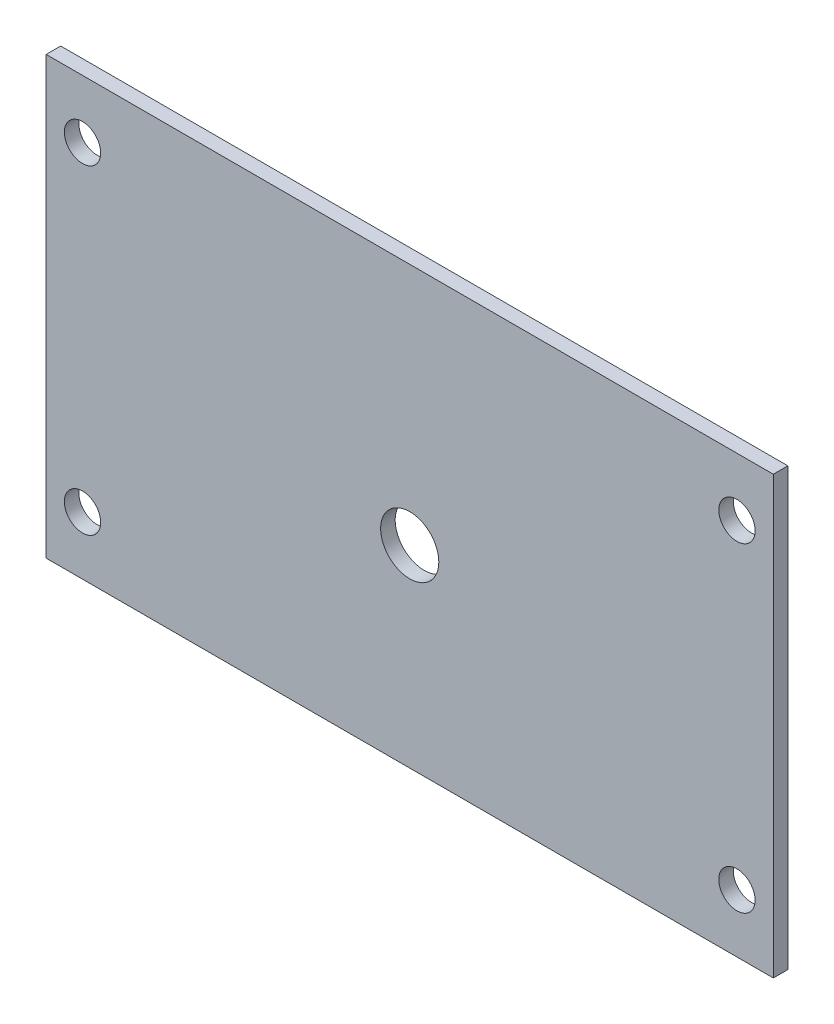
ISO-10303-21;
HEADER;
FILE_DESCRIPTION(('STEP AP214'),'2;1');
FILE_NAME('part.step','',(''),(''),'','','');
FILE_SCHEMA(('AUTOMOTIVE_DESIGN { 1 0 10303 214 1 1 1 1 }'));
ENDSEC;
DATA;
#1=APPLICATION_CONTEXT('core data for automotive mechanical design processes');
#2=APPLICATION_PROTOCOL_DEFINITION('international standard','automotive_design',2000,#1);
#3=PRODUCT_CONTEXT('',#1,'mechanical');
#4=PRODUCT('Part','Part','',(#3));
#5=PRODUCT_RELATED_PRODUCT_CATEGORY('part','',(#4));
#6=PRODUCT_DEFINITION_FORMATION('','',#4);
#7=PRODUCT_DEFINITION_CONTEXT('part definition',#1,'design');
#8=PRODUCT_DEFINITION('design','',#6,#7);
#9=PRODUCT_DEFINITION_SHAPE('','',#8);
#10=(LENGTH_UNIT() NAMED_UNIT(*) SI_UNIT(.MILLI.,.METRE.));
#11=(NAMED_UNIT(*) PLANE_ANGLE_UNIT() SI_UNIT($,.RADIAN.));
#12=(NAMED_UNIT(*) SI_UNIT($,.STERADIAN.) SOLID_ANGLE_UNIT());
#13=UNCERTAINTY_MEASURE_WITH_UNIT(LENGTH_MEASURE(1.E-05),#10,'distance_accuracy_value','');
#14=(GEOMETRIC_REPRESENTATION_CONTEXT(3) GLOBAL_UNCERTAINTY_ASSIGNED_CONTEXT((#13)) GLOBAL_UNIT_ASSIGNED_CONTEXT((#10,
#11,#12)) REPRESENTATION_CONTEXT('',''));
#15=CARTESIAN_POINT('',(0.,0.,0.));
#16=DIRECTION('',(0.,0.,1.));
#17=DIRECTION('',(1.,0.,0.));
#18=AXIS2_PLACEMENT_3D('',#15,#16,#17);
#19=CARTESIAN_POINT('',(0.,0.,2.));
#20=DIRECTION('',(0.,0.,-1.));
#21=DIRECTION('',(-1.,0.,0.));
#22=AXIS2_PLACEMENT_3D('',#19,#20,#21);
#23=PLANE('',#22);
#24=DIRECTION('',(0.,1.,0.));
#25=VECTOR('',#24,1.);
#26=CARTESIAN_POINT('',(50.,-30.,2.));
#27=LINE('',#26,#25);
#28=CARTESIAN_POINT('',(50.,-30.,2.));
#29=VERTEX_POINT('',#28);
#30=CARTESIAN_POINT('',(50.,30.,2.));
#31=VERTEX_POINT('',#30);
#32=EDGE_CURVE('E87',#29,#31,#27,.T.);
#33=ORIENTED_EDGE('',*,*,#32,.T.);
#34=DIRECTION('',(-1.,0.,0.));
#35=VECTOR('',#34,1.);
#36=CARTESIAN_POINT('',(-50.,30.,2.));
#37=LINE('',#36,#35);
#38=CARTESIAN_POINT('',(-50.,30.,2.));
#39=VERTEX_POINT('',#38);
#40=EDGE_CURVE('E82',#31,#39,#37,.T.);
#41=ORIENTED_EDGE('',*,*,#40,.T.);
#42=DIRECTION('',(0.,-1.,0.));
#43=VECTOR('',#42,1.);
#44=CARTESIAN_POINT('',(-50.,-30.,2.));
#45=LINE('',#44,#43);
#46=CARTESIAN_POINT('',(-50.,-30.,2.));
#47=VERTEX_POINT('',#46);
#48=EDGE_CURVE('E85',#39,#47,#45,.T.);
#49=ORIENTED_EDGE('',*,*,#48,.T.);
#50=DIRECTION('',(1.,0.,0.));
#51=VECTOR('',#50,1.);
#52=CARTESIAN_POINT('',(-50.,-30.,2.));
#53=LINE('',#52,#51);
#54=EDGE_CURVE('E52',#47,#29,#53,.T.);
#55=ORIENTED_EDGE('',*,*,#54,.T.);
#56=EDGE_LOOP('',(#33,#41,#49,#55));
#57=FACE_BOUND('',#56,.T.);
#58=CARTESIAN_POINT('',(0.,-3.45884045745933,2.));
#59=DIRECTION('',(0.,0.,1.));
#60=DIRECTION('',(1.,0.,0.));
#61=AXIS2_PLACEMENT_3D('',#58,#59,#60);
#62=CIRCLE('',#61,4.);
#63=CARTESIAN_POINT('',(4.,-3.45884045745933,2.));
#64=VERTEX_POINT('',#63);
#65=EDGE_CURVE('E102',#64,#64,#62,.T.);
#66=ORIENTED_EDGE('',*,*,#65,.F.);
#67=EDGE_LOOP('',(#66));
#68=FACE_BOUND('',#67,.T.);
#69=CARTESIAN_POINT('',(-45.,22.,2.));
#70=DIRECTION('',(0.,0.,1.));
#71=DIRECTION('',(1.,0.,0.));
#72=AXIS2_PLACEMENT_3D('',#69,#70,#71);
#73=CIRCLE('',#72,2.5);
#74=CARTESIAN_POINT('',(-42.5,22.,2.));
#75=VERTEX_POINT('',#74);
#76=EDGE_CURVE('E117',#75,#75,#73,.T.);
#77=ORIENTED_EDGE('',*,*,#76,.F.);
#78=EDGE_LOOP('',(#77));
#79=FACE_BOUND('',#78,.T.);
#80=CARTESIAN_POINT('',(-45.,-22.,2.));
#81=DIRECTION('',(0.,0.,1.));
#82=DIRECTION('',(1.,0.,0.));
#83=AXIS2_PLACEMENT_3D('',#80,#81,#82);
#84=CIRCLE('',#83,2.5);
#85=CARTESIAN_POINT('',(-42.5,-22.,2.));
#86=VERTEX_POINT('',#85);
#87=EDGE_CURVE('E123',#86,#86,#84,.T.);
#88=ORIENTED_EDGE('',*,*,#87,.F.);
#89=EDGE_LOOP('',(#88));
#90=FACE_BOUND('',#89,.T.);
#91=CARTESIAN_POINT('',(45.,-22.,2.));
#92=DIRECTION('',(0.,0.,1.));
#93=DIRECTION('',(-1.,0.,0.));
#94=AXIS2_PLACEMENT_3D('',#91,#92,#93);
#95=CIRCLE('',#94,2.5);
#96=CARTESIAN_POINT('',(42.5,-22.,2.));
#97=VERTEX_POINT('',#96);
#98=EDGE_CURVE('E129',#97,#97,#95,.T.);
#99=ORIENTED_EDGE('',*,*,#98,.F.);
#100=EDGE_LOOP('',(#99));
#101=FACE_BOUND('',#100,.T.);
#102=CARTESIAN_POINT('',(45.,22.,2.));
#103=DIRECTION('',(0.,0.,1.));
#104=DIRECTION('',(-1.,0.,0.));
#105=AXIS2_PLACEMENT_3D('',#102,#103,#104);
#106=CIRCLE('',#105,2.5);
#107=CARTESIAN_POINT('',(42.5,22.,2.));
#108=VERTEX_POINT('',#107);
#109=EDGE_CURVE('E135',#108,#108,#106,.T.);
#110=ORIENTED_EDGE('',*,*,#109,.F.);
#111=EDGE_LOOP('',(#110));
#112=FACE_BOUND('',#111,.T.);
#113=ADVANCED_FACE('F35',(#57,#68,#79,#90,#101,#112),#23,.F.);
#114=CARTESIAN_POINT('',(0.,0.,0.));
#115=DIRECTION('',(0.,0.,-1.));
#116=DIRECTION('',(-1.,0.,0.));
#117=AXIS2_PLACEMENT_3D('',#114,#115,#116);
#118=PLANE('',#117);
#119=CARTESIAN_POINT('',(45.,-22.,0.));
#120=DIRECTION('',(0.,0.,1.));
#121=DIRECTION('',(-1.,0.,0.));
#122=AXIS2_PLACEMENT_3D('',#119,#120,#121);
#123=CIRCLE('',#122,2.5);
#124=CARTESIAN_POINT('',(42.5,-22.,0.));
#125=VERTEX_POINT('',#124);
#126=EDGE_CURVE('E132',#125,#125,#123,.T.);
#127=ORIENTED_EDGE('',*,*,#126,.T.);
#128=EDGE_LOOP('',(#127));
#129=FACE_BOUND('',#128,.T.);
#130=CARTESIAN_POINT('',(-45.,22.,0.));
#131=DIRECTION('',(0.,0.,1.));
#132=DIRECTION('',(1.,0.,0.));
#133=AXIS2_PLACEMENT_3D('',#130,#131,#132);
#134=CIRCLE('',#133,2.5);
#135=CARTESIAN_POINT('',(-42.5,22.,0.));
#136=VERTEX_POINT('',#135);
#137=EDGE_CURVE('E120',#136,#136,#134,.T.);
#138=ORIENTED_EDGE('',*,*,#137,.T.);
#139=EDGE_LOOP('',(#138));
#140=FACE_BOUND('',#139,.T.);
#141=DIRECTION('',(0.,1.,0.));
#142=VECTOR('',#141,1.);
#143=CARTESIAN_POINT('',(50.,-30.,0.));
#144=LINE('',#143,#142);
#145=CARTESIAN_POINT('',(50.,-30.,0.));
#146=VERTEX_POINT('',#145);
#147=CARTESIAN_POINT('',(50.,30.,0.));
#148=VERTEX_POINT('',#147);
#149=EDGE_CURVE('E99',#146,#148,#144,.T.);
#150=ORIENTED_EDGE('',*,*,#149,.F.);
#151=DIRECTION('',(1.,0.,0.));
#152=VECTOR('',#151,1.);
#153=CARTESIAN_POINT('',(-50.,-30.,0.));
#154=LINE('',#153,#152);
#155=CARTESIAN_POINT('',(-50.,-30.,0.));
#156=VERTEX_POINT('',#155);
#157=EDGE_CURVE('E75',#156,#146,#154,.T.);
#158=ORIENTED_EDGE('',*,*,#157,.F.);
#159=DIRECTION('',(0.,-1.,0.));
#160=VECTOR('',#159,1.);
#161=CARTESIAN_POINT('',(-50.,-30.,0.));
#162=LINE('',#161,#160);
#163=CARTESIAN_POINT('',(-50.,30.,0.));
#164=VERTEX_POINT('',#163);
#165=EDGE_CURVE('E69',#164,#156,#162,.T.);
#166=ORIENTED_EDGE('',*,*,#165,.F.);
#167=DIRECTION('',(-1.,0.,0.));
#168=VECTOR('',#167,1.);
#169=CARTESIAN_POINT('',(-50.,30.,0.));
#170=LINE('',#169,#168);
#171=EDGE_CURVE('E91',#148,#164,#170,.T.);
#172=ORIENTED_EDGE('',*,*,#171,.F.);
#173=EDGE_LOOP('',(#150,#158,#166,#172));
#174=FACE_BOUND('',#173,.T.);
#175=CARTESIAN_POINT('',(0.,-3.45884045745933,0.));
#176=DIRECTION('',(0.,0.,1.));
#177=DIRECTION('',(1.,0.,0.));
#178=AXIS2_PLACEMENT_3D('',#175,#176,#177);
#179=CIRCLE('',#178,4.);
#180=CARTESIAN_POINT('',(4.,-3.45884045745933,0.));
#181=VERTEX_POINT('',#180);
#182=EDGE_CURVE('E114',#181,#181,#179,.T.);
#183=ORIENTED_EDGE('',*,*,#182,.T.);
#184=EDGE_LOOP('',(#183));
#185=FACE_BOUND('',#184,.T.);
#186=CARTESIAN_POINT('',(-45.,-22.,0.));
#187=DIRECTION('',(0.,0.,1.));
#188=DIRECTION('',(1.,0.,0.));
#189=AXIS2_PLACEMENT_3D('',#186,#187,#188);
#190=CIRCLE('',#189,2.5);
#191=CARTESIAN_POINT('',(-42.5,-22.,0.));
#192=VERTEX_POINT('',#191);
#193=EDGE_CURVE('E126',#192,#192,#190,.T.);
#194=ORIENTED_EDGE('',*,*,#193,.T.);
#195=EDGE_LOOP('',(#194));
#196=FACE_BOUND('',#195,.T.);
#197=CARTESIAN_POINT('',(45.,22.,0.));
#198=DIRECTION('',(0.,0.,1.));
#199=DIRECTION('',(-1.,0.,0.));
#200=AXIS2_PLACEMENT_3D('',#197,#198,#199);
#201=CIRCLE('',#200,2.5);
#202=CARTESIAN_POINT('',(42.5,22.,0.));
#203=VERTEX_POINT('',#202);
#204=EDGE_CURVE('E138',#203,#203,#201,.T.);
#205=ORIENTED_EDGE('',*,*,#204,.T.);
#206=EDGE_LOOP('',(#205));
#207=FACE_BOUND('',#206,.T.);
#208=ADVANCED_FACE('F110',(#129,#140,#174,#185,#196,#207),#118,.T.);
#209=CARTESIAN_POINT('',(50.,-30.,2.));
#210=DIRECTION('',(-1.,0.,0.));
#211=DIRECTION('',(0.,0.,1.));
#212=AXIS2_PLACEMENT_3D('',#209,#210,#211);
#213=PLANE('',#212);
#214=ORIENTED_EDGE('',*,*,#149,.T.);
#215=DIRECTION('',(0.,0.,-1.));
#216=VECTOR('',#215,1.);
#217=CARTESIAN_POINT('',(50.,30.,2.));
#218=LINE('',#217,#216);
#219=EDGE_CURVE('E11',#31,#148,#218,.T.);
#220=ORIENTED_EDGE('',*,*,#219,.F.);
#221=ORIENTED_EDGE('',*,*,#32,.F.);
#222=DIRECTION('',(0.,0.,-1.));
#223=VECTOR('',#222,1.);
#224=CARTESIAN_POINT('',(50.,-30.,2.));
#225=LINE('',#224,#223);
#226=EDGE_CURVE('E95',#29,#146,#225,.T.);
#227=ORIENTED_EDGE('',*,*,#226,.T.);
#228=EDGE_LOOP('',(#214,#220,#221,#227));
#229=FACE_BOUND('',#228,.T.);
#230=ADVANCED_FACE('F37',(#229),#213,.F.);
#231=CARTESIAN_POINT('',(-50.,30.,2.));
#232=DIRECTION('',(0.,-1.,0.));
#233=DIRECTION('',(0.,0.,-1.));
#234=AXIS2_PLACEMENT_3D('',#231,#232,#233);
#235=PLANE('',#234);
#236=ORIENTED_EDGE('',*,*,#171,.T.);
#237=DIRECTION('',(0.,0.,-1.));
#238=VECTOR('',#237,1.);
#239=CARTESIAN_POINT('',(-50.,30.,2.));
#240=LINE('',#239,#238);
#241=EDGE_CURVE('E44',#39,#164,#240,.T.);
#242=ORIENTED_EDGE('',*,*,#241,.F.);
#243=ORIENTED_EDGE('',*,*,#40,.F.);
#244=ORIENTED_EDGE('',*,*,#219,.T.);
#245=EDGE_LOOP('',(#236,#242,#243,#244));
#246=FACE_BOUND('',#245,.T.);
#247=ADVANCED_FACE('F90',(#246),#235,.F.);
#248=CARTESIAN_POINT('',(-50.,-30.,2.));
#249=DIRECTION('',(1.,0.,0.));
#250=DIRECTION('',(0.,0.,-1.));
#251=AXIS2_PLACEMENT_3D('',#248,#249,#250);
#252=PLANE('',#251);
#253=ORIENTED_EDGE('',*,*,#165,.T.);
#254=DIRECTION('',(0.,0.,-1.));
#255=VECTOR('',#254,1.);
#256=CARTESIAN_POINT('',(-50.,-30.,2.));
#257=LINE('',#256,#255);
#258=EDGE_CURVE('E92',#47,#156,#257,.T.);
#259=ORIENTED_EDGE('',*,*,#258,.F.);
#260=ORIENTED_EDGE('',*,*,#48,.F.);
#261=ORIENTED_EDGE('',*,*,#241,.T.);
#262=EDGE_LOOP('',(#253,#259,#260,#261));
#263=FACE_BOUND('',#262,.T.);
#264=ADVANCED_FACE('F93',(#263),#252,.F.);
#265=CARTESIAN_POINT('',(-50.,-30.,2.));
#266=DIRECTION('',(0.,1.,0.));
#267=DIRECTION('',(0.,0.,1.));
#268=AXIS2_PLACEMENT_3D('',#265,#266,#267);
#269=PLANE('',#268);
#270=ORIENTED_EDGE('',*,*,#157,.T.);
#271=ORIENTED_EDGE('',*,*,#226,.F.);
#272=ORIENTED_EDGE('',*,*,#54,.F.);
#273=ORIENTED_EDGE('',*,*,#258,.T.);
#274=EDGE_LOOP('',(#270,#271,#272,#273));
#275=FACE_BOUND('',#274,.T.);
#276=ADVANCED_FACE('F107',(#275),#269,.F.);
#277=CARTESIAN_POINT('',(0.,-3.45884045745933,2.));
#278=DIRECTION('',(0.,0.,-1.));
#279=DIRECTION('',(-1.,0.,0.));
#280=AXIS2_PLACEMENT_3D('',#277,#278,#279);
#281=CYLINDRICAL_SURFACE('',#280,4.);
#282=ORIENTED_EDGE('',*,*,#65,.T.);
#283=EDGE_LOOP('',(#282));
#284=FACE_BOUND('',#283,.T.);
#285=ORIENTED_EDGE('',*,*,#182,.F.);
#286=EDGE_LOOP('',(#285));
#287=FACE_BOUND('',#286,.T.);
#288=ADVANCED_FACE('F155',(#284,#287),#281,.F.);
#289=CARTESIAN_POINT('',(-45.,22.,2.));
#290=DIRECTION('',(0.,0.,-1.));
#291=DIRECTION('',(-1.,0.,0.));
#292=AXIS2_PLACEMENT_3D('',#289,#290,#291);
#293=CYLINDRICAL_SURFACE('',#292,2.5);
#294=ORIENTED_EDGE('',*,*,#76,.T.);
#295=EDGE_LOOP('',(#294));
#296=FACE_BOUND('',#295,.T.);
#297=ORIENTED_EDGE('',*,*,#137,.F.);
#298=EDGE_LOOP('',(#297));
#299=FACE_BOUND('',#298,.T.);
#300=ADVANCED_FACE('F201',(#296,#299),#293,.F.);
#301=CARTESIAN_POINT('',(-45.,-22.,2.));
#302=DIRECTION('',(0.,0.,-1.));
#303=DIRECTION('',(-1.,0.,0.));
#304=AXIS2_PLACEMENT_3D('',#301,#302,#303);
#305=CYLINDRICAL_SURFACE('',#304,2.5);
#306=ORIENTED_EDGE('',*,*,#87,.T.);
#307=EDGE_LOOP('',(#306));
#308=FACE_BOUND('',#307,.T.);
#309=ORIENTED_EDGE('',*,*,#193,.F.);
#310=EDGE_LOOP('',(#309));
#311=FACE_BOUND('',#310,.T.);
#312=ADVANCED_FACE('F209',(#308,#311),#305,.F.);
#313=CARTESIAN_POINT('',(45.,-22.,2.));
#314=DIRECTION('',(0.,0.,-1.));
#315=DIRECTION('',(-1.,0.,0.));
#316=AXIS2_PLACEMENT_3D('',#313,#314,#315);
#317=CYLINDRICAL_SURFACE('',#316,2.5);
#318=ORIENTED_EDGE('',*,*,#98,.T.);
#319=EDGE_LOOP('',(#318));
#320=FACE_BOUND('',#319,.T.);
#321=ORIENTED_EDGE('',*,*,#126,.F.);
#322=EDGE_LOOP('',(#321));
#323=FACE_BOUND('',#322,.T.);
#324=ADVANCED_FACE('F217',(#320,#323),#317,.F.);
#325=CARTESIAN_POINT('',(45.,22.,2.));
#326=DIRECTION('',(0.,0.,-1.));
#327=DIRECTION('',(-1.,0.,0.));
#328=AXIS2_PLACEMENT_3D('',#325,#326,#327);
#329=CYLINDRICAL_SURFACE('',#328,2.5);
#330=ORIENTED_EDGE('',*,*,#109,.T.);
#331=EDGE_LOOP('',(#330));
#332=FACE_BOUND('',#331,.T.);
#333=ORIENTED_EDGE('',*,*,#204,.F.);
#334=EDGE_LOOP('',(#333));
#335=FACE_BOUND('',#334,.T.);
#336=ADVANCED_FACE('F144',(#332,#335),#329,.F.);
#337=CLOSED_SHELL('',(#113,#208,#230,#247,#264,#276,#288,#300,#312,#324,#336));
#338=MANIFOLD_SOLID_BREP('B2',#337);
#339=ADVANCED_BREP_SHAPE_REPRESENTATION('',(#18,#338),#14);
#340=SHAPE_DEFINITION_REPRESENTATION(#9,#339);
ENDSEC;
END-ISO-10303-21;
